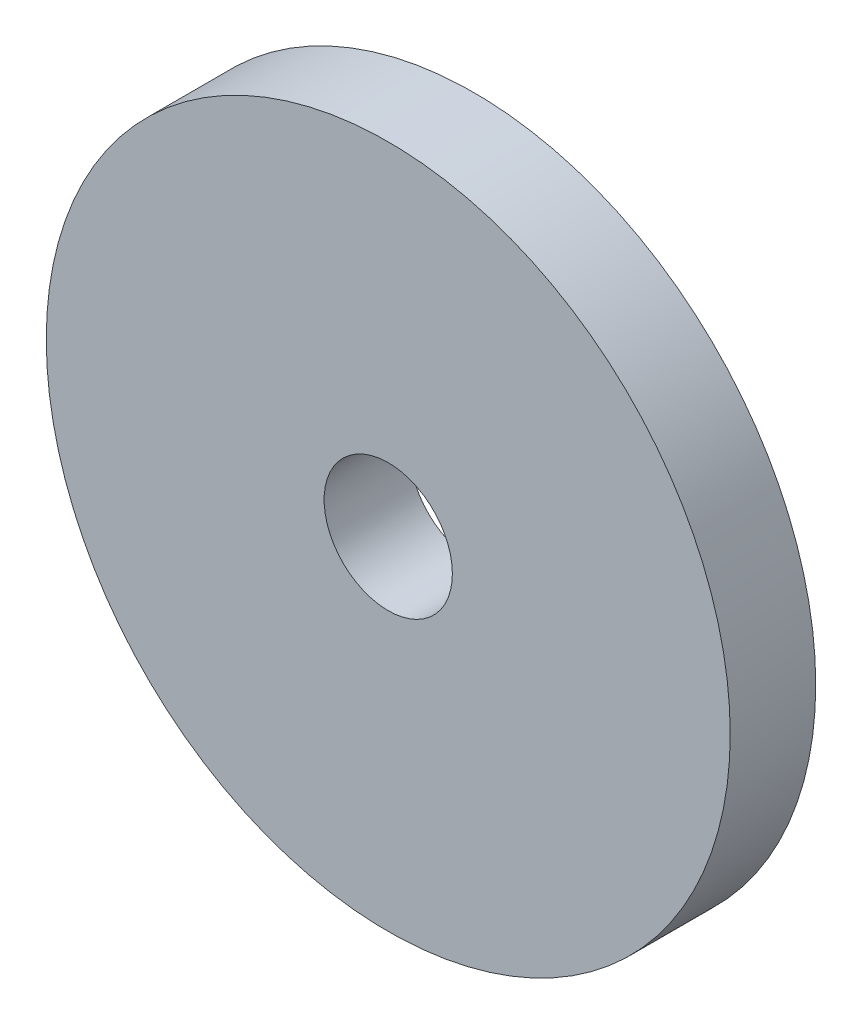
ISO-10303-21;
HEADER;
FILE_DESCRIPTION(('STEP AP214'),'2;1');
FILE_NAME('part.step','',(''),(''),'','','');
FILE_SCHEMA(('AUTOMOTIVE_DESIGN { 1 0 10303 214 1 1 1 1 }'));
ENDSEC;
DATA;
#1=APPLICATION_CONTEXT('core data for automotive mechanical design processes');
#2=APPLICATION_PROTOCOL_DEFINITION('international standard','automotive_design',2000,#1);
#3=PRODUCT_CONTEXT('',#1,'mechanical');
#4=PRODUCT('Part','Part','',(#3));
#5=PRODUCT_RELATED_PRODUCT_CATEGORY('part','',(#4));
#6=PRODUCT_DEFINITION_FORMATION('','',#4);
#7=PRODUCT_DEFINITION_CONTEXT('part definition',#1,'design');
#8=PRODUCT_DEFINITION('design','',#6,#7);
#9=PRODUCT_DEFINITION_SHAPE('','',#8);
#10=(LENGTH_UNIT() NAMED_UNIT(*) SI_UNIT(.MILLI.,.METRE.));
#11=(NAMED_UNIT(*) PLANE_ANGLE_UNIT() SI_UNIT($,.RADIAN.));
#12=(NAMED_UNIT(*) SI_UNIT($,.STERADIAN.) SOLID_ANGLE_UNIT());
#13=UNCERTAINTY_MEASURE_WITH_UNIT(LENGTH_MEASURE(1.E-05),#10,'distance_accuracy_value','');
#14=(GEOMETRIC_REPRESENTATION_CONTEXT(3) GLOBAL_UNCERTAINTY_ASSIGNED_CONTEXT((#13)) GLOBAL_UNIT_ASSIGNED_CONTEXT((#10,
#11,#12)) REPRESENTATION_CONTEXT('',''));
#15=CARTESIAN_POINT('',(0.,0.,0.));
#16=DIRECTION('',(0.,0.,1.));
#17=DIRECTION('',(1.,0.,0.));
#18=AXIS2_PLACEMENT_3D('',#15,#16,#17);
#19=CARTESIAN_POINT('',(0.,0.,2.));
#20=DIRECTION('',(0.,0.,1.));
#21=DIRECTION('',(1.,0.,0.));
#22=AXIS2_PLACEMENT_3D('',#19,#20,#21);
#23=PLANE('',#22);
#24=CARTESIAN_POINT('',(0.,0.,2.));
#25=DIRECTION('',(0.,0.,1.));
#26=DIRECTION('',(1.,0.,0.));
#27=AXIS2_PLACEMENT_3D('',#24,#25,#26);
#28=CIRCLE('',#27,8.);
#29=CARTESIAN_POINT('',(8.,0.,2.));
#30=VERTEX_POINT('',#29);
#31=EDGE_CURVE('E10',#30,#30,#28,.T.);
#32=ORIENTED_EDGE('',*,*,#31,.T.);
#33=EDGE_LOOP('',(#32));
#34=FACE_BOUND('',#33,.T.);
#35=CARTESIAN_POINT('',(0.,0.,2.));
#36=DIRECTION('',(0.,0.,1.));
#37=DIRECTION('',(1.,0.,0.));
#38=AXIS2_PLACEMENT_3D('',#35,#36,#37);
#39=CIRCLE('',#38,1.5);
#40=CARTESIAN_POINT('',(1.5,0.,2.));
#41=VERTEX_POINT('',#40);
#42=EDGE_CURVE('E42',#41,#41,#39,.T.);
#43=ORIENTED_EDGE('',*,*,#42,.F.);
#44=EDGE_LOOP('',(#43));
#45=FACE_BOUND('',#44,.T.);
#46=ADVANCED_FACE('F31',(#34,#45),#23,.T.);
#47=CARTESIAN_POINT('',(0.,0.,0.));
#48=DIRECTION('',(0.,0.,1.));
#49=DIRECTION('',(1.,0.,0.));
#50=AXIS2_PLACEMENT_3D('',#47,#48,#49);
#51=PLANE('',#50);
#52=CARTESIAN_POINT('',(0.,0.,0.));
#53=DIRECTION('',(0.,0.,1.));
#54=DIRECTION('',(1.,0.,0.));
#55=AXIS2_PLACEMENT_3D('',#52,#53,#54);
#56=CIRCLE('',#55,8.);
#57=CARTESIAN_POINT('',(8.,0.,0.));
#58=VERTEX_POINT('',#57);
#59=EDGE_CURVE('E35',#58,#58,#56,.T.);
#60=ORIENTED_EDGE('',*,*,#59,.F.);
#61=EDGE_LOOP('',(#60));
#62=FACE_BOUND('',#61,.T.);
#63=CARTESIAN_POINT('',(0.,0.,0.));
#64=DIRECTION('',(0.,0.,1.));
#65=DIRECTION('',(1.,0.,0.));
#66=AXIS2_PLACEMENT_3D('',#63,#64,#65);
#67=CIRCLE('',#66,1.5);
#68=CARTESIAN_POINT('',(1.5,0.,0.));
#69=VERTEX_POINT('',#68);
#70=EDGE_CURVE('E44',#69,#69,#67,.T.);
#71=ORIENTED_EDGE('',*,*,#70,.T.);
#72=EDGE_LOOP('',(#71));
#73=FACE_BOUND('',#72,.T.);
#74=ADVANCED_FACE('F54',(#62,#73),#51,.F.);
#75=CARTESIAN_POINT('',(0.,0.,2.));
#76=DIRECTION('',(0.,0.,-1.));
#77=DIRECTION('',(-1.,0.,0.));
#78=AXIS2_PLACEMENT_3D('',#75,#76,#77);
#79=CYLINDRICAL_SURFACE('',#78,8.);
#80=ORIENTED_EDGE('',*,*,#31,.F.);
#81=EDGE_LOOP('',(#80));
#82=FACE_BOUND('',#81,.T.);
#83=ORIENTED_EDGE('',*,*,#59,.T.);
#84=EDGE_LOOP('',(#83));
#85=FACE_BOUND('',#84,.T.);
#86=ADVANCED_FACE('F33',(#82,#85),#79,.T.);
#87=CARTESIAN_POINT('',(0.,0.,2.));
#88=DIRECTION('',(0.,0.,-1.));
#89=DIRECTION('',(-1.,0.,0.));
#90=AXIS2_PLACEMENT_3D('',#87,#88,#89);
#91=CYLINDRICAL_SURFACE('',#90,1.5);
#92=ORIENTED_EDGE('',*,*,#42,.T.);
#93=EDGE_LOOP('',(#92));
#94=FACE_BOUND('',#93,.T.);
#95=ORIENTED_EDGE('',*,*,#70,.F.);
#96=EDGE_LOOP('',(#95));
#97=FACE_BOUND('',#96,.T.);
#98=ADVANCED_FACE('F50',(#94,#97),#91,.F.);
#99=CLOSED_SHELL('',(#46,#74,#86,#98));
#100=MANIFOLD_SOLID_BREP('B2',#99);
#101=ADVANCED_BREP_SHAPE_REPRESENTATION('',(#18,#100),#14);
#102=SHAPE_DEFINITION_REPRESENTATION(#9,#101);
ENDSEC;
END-ISO-10303-21;
